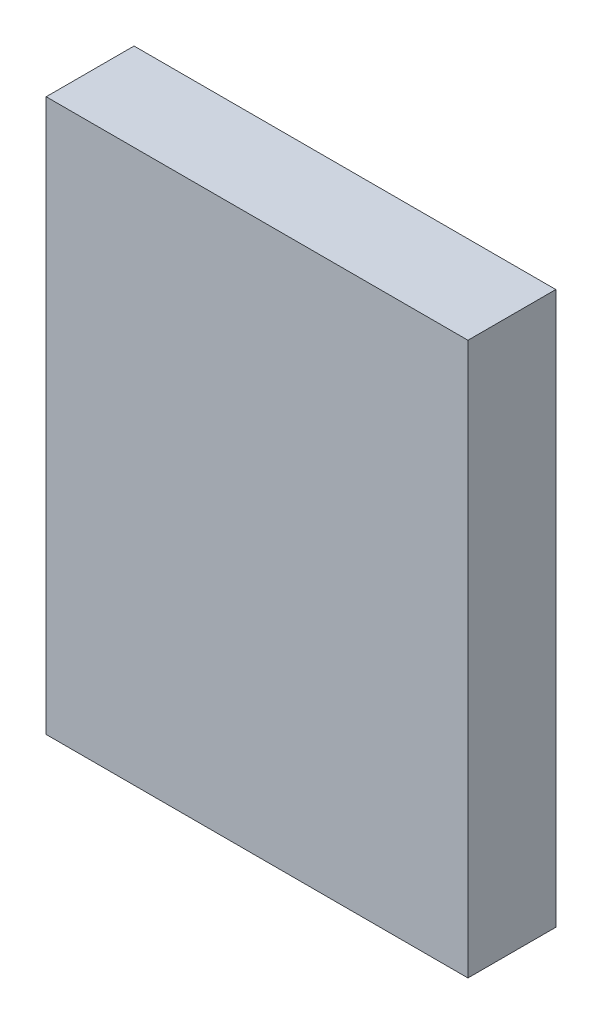
ISO-10303-21;
HEADER;
FILE_DESCRIPTION(('STEP AP214'),'2;1');
FILE_NAME('part.step','',(''),(''),'','','');
FILE_SCHEMA(('AUTOMOTIVE_DESIGN { 1 0 10303 214 1 1 1 1 }'));
ENDSEC;
DATA;
#1=APPLICATION_CONTEXT('core data for automotive mechanical design processes');
#2=APPLICATION_PROTOCOL_DEFINITION('international standard','automotive_design',2000,#1);
#3=PRODUCT_CONTEXT('',#1,'mechanical');
#4=PRODUCT('Part','Part','',(#3));
#5=PRODUCT_RELATED_PRODUCT_CATEGORY('part','',(#4));
#6=PRODUCT_DEFINITION_FORMATION('','',#4);
#7=PRODUCT_DEFINITION_CONTEXT('part definition',#1,'design');
#8=PRODUCT_DEFINITION('design','',#6,#7);
#9=PRODUCT_DEFINITION_SHAPE('','',#8);
#10=(LENGTH_UNIT() NAMED_UNIT(*) SI_UNIT(.MILLI.,.METRE.));
#11=(NAMED_UNIT(*) PLANE_ANGLE_UNIT() SI_UNIT($,.RADIAN.));
#12=(NAMED_UNIT(*) SI_UNIT($,.STERADIAN.) SOLID_ANGLE_UNIT());
#13=UNCERTAINTY_MEASURE_WITH_UNIT(LENGTH_MEASURE(1.E-05),#10,'distance_accuracy_value','');
#14=(GEOMETRIC_REPRESENTATION_CONTEXT(3) GLOBAL_UNCERTAINTY_ASSIGNED_CONTEXT((#13)) GLOBAL_UNIT_ASSIGNED_CONTEXT((#10,
#11,#12)) REPRESENTATION_CONTEXT('',''));
#15=CARTESIAN_POINT('',(0.,0.,0.));
#16=DIRECTION('',(0.,0.,1.));
#17=DIRECTION('',(1.,0.,0.));
#18=AXIS2_PLACEMENT_3D('',#15,#16,#17);
#19=CARTESIAN_POINT('',(0.,0.,44.45));
#20=DIRECTION('',(1.,0.,0.));
#21=DIRECTION('',(0.,1.,0.));
#22=AXIS2_PLACEMENT_3D('',#19,#20,#21);
#23=PLANE('',#22);
#24=DIRECTION('',(0.,-1.,0.));
#25=VECTOR('',#24,1.);
#26=CARTESIAN_POINT('',(0.,0.,0.));
#27=LINE('',#26,#25);
#28=CARTESIAN_POINT('',(0.,279.4,0.));
#29=VERTEX_POINT('',#28);
#30=CARTESIAN_POINT('',(0.,0.,0.));
#31=VERTEX_POINT('',#30);
#32=EDGE_CURVE('E96',#29,#31,#27,.T.);
#33=ORIENTED_EDGE('',*,*,#32,.T.);
#34=DIRECTION('',(0.,0.,-1.));
#35=VECTOR('',#34,1.);
#36=CARTESIAN_POINT('',(0.,0.,44.45));
#37=LINE('',#36,#35);
#38=CARTESIAN_POINT('',(0.,0.,44.45));
#39=VERTEX_POINT('',#38);
#40=EDGE_CURVE('E11',#39,#31,#37,.T.);
#41=ORIENTED_EDGE('',*,*,#40,.F.);
#42=DIRECTION('',(0.,-1.,0.));
#43=VECTOR('',#42,1.);
#44=CARTESIAN_POINT('',(0.,0.,44.45));
#45=LINE('',#44,#43);
#46=CARTESIAN_POINT('',(0.,279.4,44.45));
#47=VERTEX_POINT('',#46);
#48=EDGE_CURVE('E84',#47,#39,#45,.T.);
#49=ORIENTED_EDGE('',*,*,#48,.F.);
#50=DIRECTION('',(0.,0.,-1.));
#51=VECTOR('',#50,1.);
#52=CARTESIAN_POINT('',(0.,279.4,44.45));
#53=LINE('',#52,#51);
#54=EDGE_CURVE('E92',#47,#29,#53,.T.);
#55=ORIENTED_EDGE('',*,*,#54,.T.);
#56=EDGE_LOOP('',(#33,#41,#49,#55));
#57=FACE_BOUND('',#56,.T.);
#58=ADVANCED_FACE('F33',(#57),#23,.F.);
#59=CARTESIAN_POINT('',(0.,0.,44.45));
#60=DIRECTION('',(0.,1.,0.));
#61=DIRECTION('',(0.,0.,1.));
#62=AXIS2_PLACEMENT_3D('',#59,#60,#61);
#63=PLANE('',#62);
#64=DIRECTION('',(1.,0.,0.));
#65=VECTOR('',#64,1.);
#66=CARTESIAN_POINT('',(0.,0.,0.));
#67=LINE('',#66,#65);
#68=CARTESIAN_POINT('',(213.36,0.,0.));
#69=VERTEX_POINT('',#68);
#70=EDGE_CURVE('E88',#31,#69,#67,.T.);
#71=ORIENTED_EDGE('',*,*,#70,.T.);
#72=DIRECTION('',(0.,0.,-1.));
#73=VECTOR('',#72,1.);
#74=CARTESIAN_POINT('',(213.36,0.,44.45));
#75=LINE('',#74,#73);
#76=CARTESIAN_POINT('',(213.36,0.,44.45));
#77=VERTEX_POINT('',#76);
#78=EDGE_CURVE('E41',#77,#69,#75,.T.);
#79=ORIENTED_EDGE('',*,*,#78,.F.);
#80=DIRECTION('',(1.,0.,0.));
#81=VECTOR('',#80,1.);
#82=CARTESIAN_POINT('',(0.,0.,44.45));
#83=LINE('',#82,#81);
#84=EDGE_CURVE('E79',#39,#77,#83,.T.);
#85=ORIENTED_EDGE('',*,*,#84,.F.);
#86=ORIENTED_EDGE('',*,*,#40,.T.);
#87=EDGE_LOOP('',(#71,#79,#85,#86));
#88=FACE_BOUND('',#87,.T.);
#89=ADVANCED_FACE('F87',(#88),#63,.F.);
#90=CARTESIAN_POINT('',(213.36,0.,44.45));
#91=DIRECTION('',(-1.,0.,0.));
#92=DIRECTION('',(0.,-1.,0.));
#93=AXIS2_PLACEMENT_3D('',#90,#91,#92);
#94=PLANE('',#93);
#95=DIRECTION('',(0.,1.,0.));
#96=VECTOR('',#95,1.);
#97=CARTESIAN_POINT('',(213.36,0.,0.));
#98=LINE('',#97,#96);
#99=CARTESIAN_POINT('',(213.36,279.4,0.));
#100=VERTEX_POINT('',#99);
#101=EDGE_CURVE('E66',#69,#100,#98,.T.);
#102=ORIENTED_EDGE('',*,*,#101,.T.);
#103=DIRECTION('',(0.,0.,-1.));
#104=VECTOR('',#103,1.);
#105=CARTESIAN_POINT('',(213.36,279.4,44.45));
#106=LINE('',#105,#104);
#107=CARTESIAN_POINT('',(213.36,279.4,44.45));
#108=VERTEX_POINT('',#107);
#109=EDGE_CURVE('E89',#108,#100,#106,.T.);
#110=ORIENTED_EDGE('',*,*,#109,.F.);
#111=DIRECTION('',(0.,1.,0.));
#112=VECTOR('',#111,1.);
#113=CARTESIAN_POINT('',(213.36,0.,44.45));
#114=LINE('',#113,#112);
#115=EDGE_CURVE('E82',#77,#108,#114,.T.);
#116=ORIENTED_EDGE('',*,*,#115,.F.);
#117=ORIENTED_EDGE('',*,*,#78,.T.);
#118=EDGE_LOOP('',(#102,#110,#116,#117));
#119=FACE_BOUND('',#118,.T.);
#120=ADVANCED_FACE('F90',(#119),#94,.F.);
#121=CARTESIAN_POINT('',(0.,279.4,44.45));
#122=DIRECTION('',(0.,-1.,0.));
#123=DIRECTION('',(0.,0.,-1.));
#124=AXIS2_PLACEMENT_3D('',#121,#122,#123);
#125=PLANE('',#124);
#126=DIRECTION('',(-1.,0.,0.));
#127=VECTOR('',#126,1.);
#128=CARTESIAN_POINT('',(0.,279.4,0.));
#129=LINE('',#128,#127);
#130=EDGE_CURVE('E72',#100,#29,#129,.T.);
#131=ORIENTED_EDGE('',*,*,#130,.T.);
#132=ORIENTED_EDGE('',*,*,#54,.F.);
#133=DIRECTION('',(-1.,0.,0.));
#134=VECTOR('',#133,1.);
#135=CARTESIAN_POINT('',(0.,279.4,44.45));
#136=LINE('',#135,#134);
#137=EDGE_CURVE('E49',#108,#47,#136,.T.);
#138=ORIENTED_EDGE('',*,*,#137,.F.);
#139=ORIENTED_EDGE('',*,*,#109,.T.);
#140=EDGE_LOOP('',(#131,#132,#138,#139));
#141=FACE_BOUND('',#140,.T.);
#142=ADVANCED_FACE('F103',(#141),#125,.F.);
#143=CARTESIAN_POINT('',(0.,0.,44.45));
#144=DIRECTION('',(0.,0.,-1.));
#145=DIRECTION('',(-1.,0.,0.));
#146=AXIS2_PLACEMENT_3D('',#143,#144,#145);
#147=PLANE('',#146);
#148=ORIENTED_EDGE('',*,*,#48,.T.);
#149=ORIENTED_EDGE('',*,*,#84,.T.);
#150=ORIENTED_EDGE('',*,*,#115,.T.);
#151=ORIENTED_EDGE('',*,*,#137,.T.);
#152=EDGE_LOOP('',(#148,#149,#150,#151));
#153=FACE_BOUND('',#152,.T.);
#154=ADVANCED_FACE('F80',(#153),#147,.F.);
#155=CARTESIAN_POINT('',(0.,0.,0.));
#156=DIRECTION('',(0.,0.,-1.));
#157=DIRECTION('',(-1.,0.,0.));
#158=AXIS2_PLACEMENT_3D('',#155,#156,#157);
#159=PLANE('',#158);
#160=ORIENTED_EDGE('',*,*,#32,.F.);
#161=ORIENTED_EDGE('',*,*,#130,.F.);
#162=ORIENTED_EDGE('',*,*,#101,.F.);
#163=ORIENTED_EDGE('',*,*,#70,.F.);
#164=EDGE_LOOP('',(#160,#161,#162,#163));
#165=FACE_BOUND('',#164,.T.);
#166=ADVANCED_FACE('F106',(#165),#159,.T.);
#167=CLOSED_SHELL('',(#58,#89,#120,#142,#154,#166));
#168=MANIFOLD_SOLID_BREP('B2',#167);
#169=ADVANCED_BREP_SHAPE_REPRESENTATION('',(#18,#168),#14);
#170=SHAPE_DEFINITION_REPRESENTATION(#9,#169);
ENDSEC;
END-ISO-10303-21;
